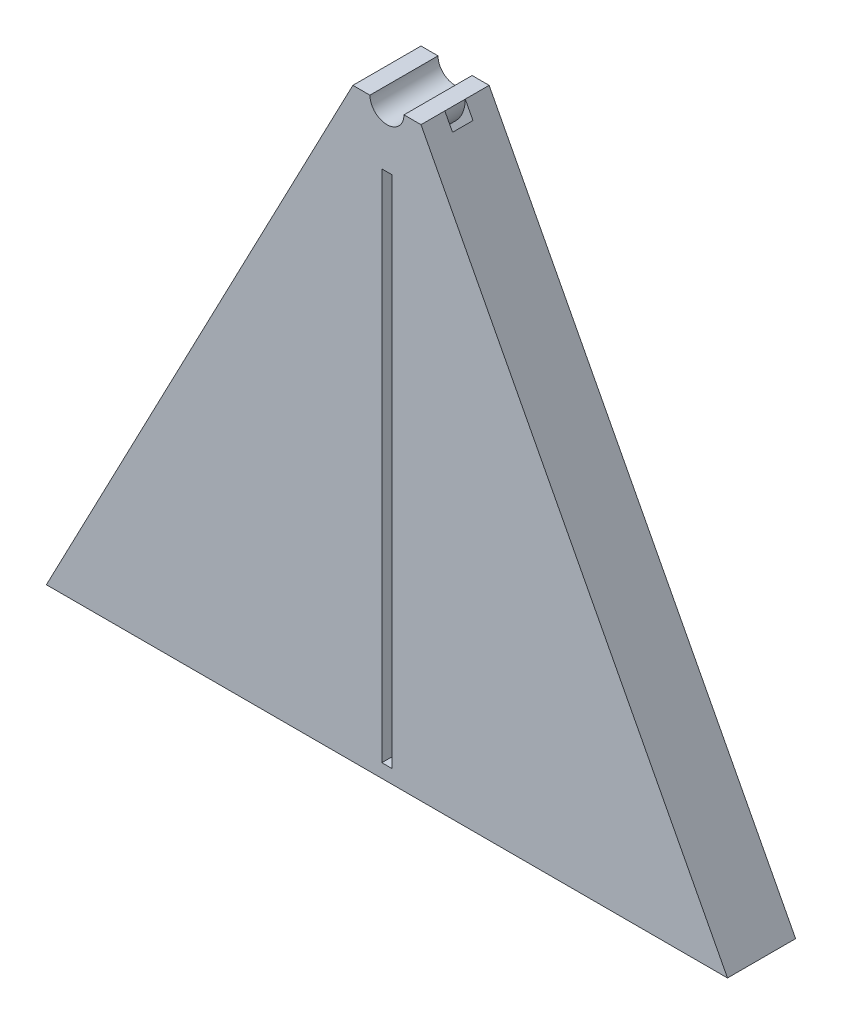
ISO-10303-21;
HEADER;
FILE_DESCRIPTION(('STEP AP214'),'2;1');
FILE_NAME('part.step','',(''),(''),'','','');
FILE_SCHEMA(('AUTOMOTIVE_DESIGN { 1 0 10303 214 1 1 1 1 }'));
ENDSEC;
DATA;
#1=APPLICATION_CONTEXT('core data for automotive mechanical design processes');
#2=APPLICATION_PROTOCOL_DEFINITION('international standard','automotive_design',2000,#1);
#3=PRODUCT_CONTEXT('',#1,'mechanical');
#4=PRODUCT('Part','Part','',(#3));
#5=PRODUCT_RELATED_PRODUCT_CATEGORY('part','',(#4));
#6=PRODUCT_DEFINITION_FORMATION('','',#4);
#7=PRODUCT_DEFINITION_CONTEXT('part definition',#1,'design');
#8=PRODUCT_DEFINITION('design','',#6,#7);
#9=PRODUCT_DEFINITION_SHAPE('','',#8);
#10=(LENGTH_UNIT() NAMED_UNIT(*) SI_UNIT(.MILLI.,.METRE.));
#11=(NAMED_UNIT(*) PLANE_ANGLE_UNIT() SI_UNIT($,.RADIAN.));
#12=(NAMED_UNIT(*) SI_UNIT($,.STERADIAN.) SOLID_ANGLE_UNIT());
#13=UNCERTAINTY_MEASURE_WITH_UNIT(LENGTH_MEASURE(1.E-05),#10,'distance_accuracy_value','');
#14=(GEOMETRIC_REPRESENTATION_CONTEXT(3) GLOBAL_UNCERTAINTY_ASSIGNED_CONTEXT((#13)) GLOBAL_UNIT_ASSIGNED_CONTEXT((#10,
#11,#12)) REPRESENTATION_CONTEXT('',''));
#15=CARTESIAN_POINT('',(0.,0.,0.));
#16=DIRECTION('',(0.,0.,1.));
#17=DIRECTION('',(1.,0.,0.));
#18=AXIS2_PLACEMENT_3D('',#15,#16,#17);
#19=CARTESIAN_POINT('',(0.,0.,3.5));
#20=DIRECTION('',(0.,0.,1.));
#21=DIRECTION('',(1.,0.,0.));
#22=AXIS2_PLACEMENT_3D('',#19,#20,#21);
#23=CYLINDRICAL_SURFACE('',#22,6.5);
#24=CARTESIAN_POINT('',(0.,0.,6.5));
#25=DIRECTION('',(0.,0.,1.));
#26=DIRECTION('',(1.,0.,0.));
#27=AXIS2_PLACEMENT_3D('',#24,#25,#26);
#28=CIRCLE('',#27,6.5);
#29=CARTESIAN_POINT('',(-6.13045913441684,-2.16043301244106,6.5));
#30=VERTEX_POINT('',#29);
#31=CARTESIAN_POINT('',(6.13045913441684,-2.16043301244105,6.5));
#32=VERTEX_POINT('',#31);
#33=EDGE_CURVE('E196',#30,#32,#28,.T.);
#34=ORIENTED_EDGE('',*,*,#33,.T.);
#35=DIRECTION('',(0.,0.,1.));
#36=VECTOR('',#35,1.);
#37=CARTESIAN_POINT('',(6.13045913441684,-2.16043301244105,3.5));
#38=LINE('',#37,#36);
#39=CARTESIAN_POINT('',(6.13045913441684,-2.16043301244106,3.5));
#40=VERTEX_POINT('',#39);
#41=EDGE_CURVE('E211',#40,#32,#38,.T.);
#42=ORIENTED_EDGE('',*,*,#41,.F.);
#43=CARTESIAN_POINT('',(0.,0.,3.5));
#44=DIRECTION('',(0.,0.,1.));
#45=DIRECTION('',(1.,0.,0.));
#46=AXIS2_PLACEMENT_3D('',#43,#44,#45);
#47=CIRCLE('',#46,6.5);
#48=CARTESIAN_POINT('',(-6.13045913441684,-2.16043301244106,3.5));
#49=VERTEX_POINT('',#48);
#50=EDGE_CURVE('E207',#49,#40,#47,.T.);
#51=ORIENTED_EDGE('',*,*,#50,.F.);
#52=DIRECTION('',(0.,0.,1.));
#53=VECTOR('',#52,1.);
#54=CARTESIAN_POINT('',(-6.13045913441684,-2.16043301244106,3.5));
#55=LINE('',#54,#53);
#56=EDGE_CURVE('E215',#30,#49,#55,.F.);
#57=ORIENTED_EDGE('',*,*,#56,.F.);
#58=EDGE_LOOP('',(#34,#42,#51,#57));
#59=FACE_BOUND('',#58,.T.);
#60=ADVANCED_FACE('F38',(#59),#23,.F.);
#61=CARTESIAN_POINT('',(0.,0.,3.5));
#62=DIRECTION('',(0.,0.,1.));
#63=DIRECTION('',(1.,0.,0.));
#64=AXIS2_PLACEMENT_3D('',#61,#62,#63);
#65=CYLINDRICAL_SURFACE('',#64,5.);
#66=DIRECTION('',(0.,0.,-1.));
#67=VECTOR('',#66,1.);
#68=CARTESIAN_POINT('',(5.,0.,10.));
#69=LINE('',#68,#67);
#70=CARTESIAN_POINT('',(5.,0.,6.5));
#71=VERTEX_POINT('',#70);
#72=CARTESIAN_POINT('',(5.,0.,3.5));
#73=VERTEX_POINT('',#72);
#74=EDGE_CURVE('E283',#71,#73,#69,.T.);
#75=ORIENTED_EDGE('',*,*,#74,.F.);
#76=CARTESIAN_POINT('',(0.,0.,6.5));
#77=DIRECTION('',(0.,0.,-1.));
#78=DIRECTION('',(1.,0.,0.));
#79=AXIS2_PLACEMENT_3D('',#76,#77,#78);
#80=CIRCLE('',#79,5.);
#81=CARTESIAN_POINT('',(-5.,0.,6.5));
#82=VERTEX_POINT('',#81);
#83=EDGE_CURVE('E183',#71,#82,#80,.T.);
#84=ORIENTED_EDGE('',*,*,#83,.T.);
#85=DIRECTION('',(0.,0.,-1.));
#86=VECTOR('',#85,1.);
#87=CARTESIAN_POINT('',(-5.,0.,10.));
#88=LINE('',#87,#86);
#89=CARTESIAN_POINT('',(-5.,0.,3.5));
#90=VERTEX_POINT('',#89);
#91=EDGE_CURVE('E271',#82,#90,#88,.T.);
#92=ORIENTED_EDGE('',*,*,#91,.T.);
#93=CARTESIAN_POINT('',(0.,0.,3.5));
#94=DIRECTION('',(0.,0.,1.));
#95=DIRECTION('',(1.,0.,0.));
#96=AXIS2_PLACEMENT_3D('',#93,#94,#95);
#97=CIRCLE('',#96,5.);
#98=EDGE_CURVE('E203',#90,#73,#97,.T.);
#99=ORIENTED_EDGE('',*,*,#98,.T.);
#100=EDGE_LOOP('',(#75,#84,#92,#99));
#101=FACE_BOUND('',#100,.T.);
#102=ADVANCED_FACE('F317',(#101),#65,.T.);
#103=CARTESIAN_POINT('',(-5.,0.,10.));
#104=DIRECTION('',(0.886033106102623,-0.463621974123465,0.));
#105=DIRECTION('',(0.463621974123465,0.886033106102623,0.));
#106=AXIS2_PLACEMENT_3D('',#103,#104,#105);
#107=PLANE('',#106);
#108=DIRECTION('',(-0.463621974123465,-0.886033106102622,0.));
#109=VECTOR('',#108,1.);
#110=CARTESIAN_POINT('',(-5.,0.,10.));
#111=LINE('',#110,#109);
#112=CARTESIAN_POINT('',(-5.,0.,10.));
#113=VERTEX_POINT('',#112);
#114=CARTESIAN_POINT('',(-50.,-86.,10.));
#115=VERTEX_POINT('',#114);
#116=EDGE_CURVE('E227',#113,#115,#111,.T.);
#117=ORIENTED_EDGE('',*,*,#116,.F.);
#118=EDGE_CURVE('E267',#113,#82,#88,.T.);
#119=ORIENTED_EDGE('',*,*,#118,.T.);
#120=DIRECTION('',(-0.463621974123465,-0.886033106102622,0.));
#121=VECTOR('',#120,1.);
#122=CARTESIAN_POINT('',(-5.,0.,6.5));
#123=LINE('',#122,#121);
#124=EDGE_CURVE('E192',#82,#30,#123,.T.);
#125=ORIENTED_EDGE('',*,*,#124,.T.);
#126=ORIENTED_EDGE('',*,*,#56,.T.);
#127=DIRECTION('',(-0.463621974123465,-0.886033106102623,0.));
#128=VECTOR('',#127,1.);
#129=CARTESIAN_POINT('',(-5.,0.,3.5));
#130=LINE('',#129,#128);
#131=EDGE_CURVE('E222',#90,#49,#130,.T.);
#132=ORIENTED_EDGE('',*,*,#131,.F.);
#133=CARTESIAN_POINT('',(-5.,0.,0.));
#134=VERTEX_POINT('',#133);
#135=EDGE_CURVE('E247',#90,#134,#88,.T.);
#136=ORIENTED_EDGE('',*,*,#135,.T.);
#137=DIRECTION('',(-0.463621974123465,-0.886033106102622,0.));
#138=VECTOR('',#137,1.);
#139=CARTESIAN_POINT('',(-5.,0.,0.));
#140=LINE('',#139,#138);
#141=CARTESIAN_POINT('',(-50.,-86.,0.));
#142=VERTEX_POINT('',#141);
#143=EDGE_CURVE('E226',#134,#142,#140,.T.);
#144=ORIENTED_EDGE('',*,*,#143,.T.);
#145=DIRECTION('',(0.,0.,-1.));
#146=VECTOR('',#145,1.);
#147=CARTESIAN_POINT('',(-50.,-86.,10.));
#148=LINE('',#147,#146);
#149=EDGE_CURVE('E11',#115,#142,#148,.T.);
#150=ORIENTED_EDGE('',*,*,#149,.F.);
#151=EDGE_LOOP('',(#117,#119,#125,#126,#132,#136,#144,#150));
#152=FACE_BOUND('',#151,.T.);
#153=ADVANCED_FACE('F40',(#152),#107,.F.);
#154=CARTESIAN_POINT('',(-50.,-86.,10.));
#155=DIRECTION('',(0.,1.,0.));
#156=DIRECTION('',(0.,0.,1.));
#157=AXIS2_PLACEMENT_3D('',#154,#155,#156);
#158=PLANE('',#157);
#159=DIRECTION('',(1.,0.,0.));
#160=VECTOR('',#159,1.);
#161=CARTESIAN_POINT('',(-50.,-86.,0.));
#162=LINE('',#161,#160);
#163=CARTESIAN_POINT('',(50.,-86.,0.));
#164=VERTEX_POINT('',#163);
#165=EDGE_CURVE('E251',#142,#164,#162,.T.);
#166=ORIENTED_EDGE('',*,*,#165,.T.);
#167=DIRECTION('',(0.,0.,-1.));
#168=VECTOR('',#167,1.);
#169=CARTESIAN_POINT('',(50.,-86.,10.));
#170=LINE('',#169,#168);
#171=CARTESIAN_POINT('',(50.,-86.,10.));
#172=VERTEX_POINT('',#171);
#173=EDGE_CURVE('E47',#172,#164,#170,.T.);
#174=ORIENTED_EDGE('',*,*,#173,.F.);
#175=DIRECTION('',(1.,0.,0.));
#176=VECTOR('',#175,1.);
#177=CARTESIAN_POINT('',(-50.,-86.,10.));
#178=LINE('',#177,#176);
#179=EDGE_CURVE('E230',#115,#172,#178,.T.);
#180=ORIENTED_EDGE('',*,*,#179,.F.);
#181=ORIENTED_EDGE('',*,*,#149,.T.);
#182=EDGE_LOOP('',(#166,#174,#180,#181));
#183=FACE_BOUND('',#182,.T.);
#184=ADVANCED_FACE('F362',(#183),#158,.F.);
#185=CARTESIAN_POINT('',(50.,-86.,10.));
#186=DIRECTION('',(-0.886033106102623,-0.463621974123465,0.));
#187=DIRECTION('',(0.463621974123465,-0.886033106102623,0.));
#188=AXIS2_PLACEMENT_3D('',#185,#186,#187);
#189=PLANE('',#188);
#190=DIRECTION('',(-0.463621974123465,0.886033106102623,0.));
#191=VECTOR('',#190,1.);
#192=CARTESIAN_POINT('',(50.,-86.,3.5));
#193=LINE('',#192,#191);
#194=EDGE_CURVE('E218',#40,#73,#193,.T.);
#195=ORIENTED_EDGE('',*,*,#194,.F.);
#196=ORIENTED_EDGE('',*,*,#41,.T.);
#197=DIRECTION('',(-0.463621974123465,0.886033106102622,0.));
#198=VECTOR('',#197,1.);
#199=CARTESIAN_POINT('',(5.,0.,6.5));
#200=LINE('',#199,#198);
#201=EDGE_CURVE('E199',#32,#71,#200,.T.);
#202=ORIENTED_EDGE('',*,*,#201,.T.);
#203=CARTESIAN_POINT('',(5.,0.,10.));
#204=VERTEX_POINT('',#203);
#205=EDGE_CURVE('E280',#204,#71,#69,.T.);
#206=ORIENTED_EDGE('',*,*,#205,.F.);
#207=DIRECTION('',(-0.463621974123465,0.886033106102622,0.));
#208=VECTOR('',#207,1.);
#209=CARTESIAN_POINT('',(50.,-86.,10.));
#210=LINE('',#209,#208);
#211=EDGE_CURVE('E234',#172,#204,#210,.T.);
#212=ORIENTED_EDGE('',*,*,#211,.F.);
#213=ORIENTED_EDGE('',*,*,#173,.T.);
#214=DIRECTION('',(-0.463621974123465,0.886033106102622,0.));
#215=VECTOR('',#214,1.);
#216=CARTESIAN_POINT('',(50.,-86.,0.));
#217=LINE('',#216,#215);
#218=CARTESIAN_POINT('',(5.,0.,0.));
#219=VERTEX_POINT('',#218);
#220=EDGE_CURVE('E254',#164,#219,#217,.T.);
#221=ORIENTED_EDGE('',*,*,#220,.T.);
#222=EDGE_CURVE('E279',#73,#219,#69,.T.);
#223=ORIENTED_EDGE('',*,*,#222,.F.);
#224=EDGE_LOOP('',(#195,#196,#202,#206,#212,#213,#221,#223));
#225=FACE_BOUND('',#224,.T.);
#226=ADVANCED_FACE('F291',(#225),#189,.F.);
#227=CARTESIAN_POINT('',(5.,0.,10.));
#228=DIRECTION('',(0.,-1.,0.));
#229=DIRECTION('',(1.,0.,0.));
#230=AXIS2_PLACEMENT_3D('',#227,#228,#229);
#231=PLANE('',#230);
#232=DIRECTION('',(-1.,0.,0.));
#233=VECTOR('',#232,1.);
#234=CARTESIAN_POINT('',(5.,0.,0.));
#235=LINE('',#234,#233);
#236=CARTESIAN_POINT('',(2.5,0.,0.));
#237=VERTEX_POINT('',#236);
#238=EDGE_CURVE('E258',#219,#237,#235,.T.);
#239=ORIENTED_EDGE('',*,*,#238,.T.);
#240=DIRECTION('',(0.,0.,-1.));
#241=VECTOR('',#240,1.);
#242=CARTESIAN_POINT('',(2.5,0.,10.));
#243=LINE('',#242,#241);
#244=CARTESIAN_POINT('',(2.5,0.,10.));
#245=VERTEX_POINT('',#244);
#246=EDGE_CURVE('E275',#245,#237,#243,.T.);
#247=ORIENTED_EDGE('',*,*,#246,.F.);
#248=DIRECTION('',(-1.,0.,0.));
#249=VECTOR('',#248,1.);
#250=CARTESIAN_POINT('',(5.,0.,10.));
#251=LINE('',#250,#249);
#252=EDGE_CURVE('E237',#204,#245,#251,.T.);
#253=ORIENTED_EDGE('',*,*,#252,.F.);
#254=ORIENTED_EDGE('',*,*,#205,.T.);
#255=ORIENTED_EDGE('',*,*,#74,.T.);
#256=ORIENTED_EDGE('',*,*,#222,.T.);
#257=EDGE_LOOP('',(#239,#247,#253,#254,#255,#256));
#258=FACE_BOUND('',#257,.T.);
#259=ADVANCED_FACE('F302',(#258),#231,.F.);
#260=CARTESIAN_POINT('',(0.,0.,10.));
#261=DIRECTION('',(0.,0.,-1.));
#262=DIRECTION('',(-1.,0.,0.));
#263=AXIS2_PLACEMENT_3D('',#260,#261,#262);
#264=CYLINDRICAL_SURFACE('',#263,2.5);
#265=CARTESIAN_POINT('',(0.,0.,0.));
#266=DIRECTION('',(0.,0.,-1.));
#267=DIRECTION('',(1.,0.,0.));
#268=AXIS2_PLACEMENT_3D('',#265,#266,#267);
#269=CIRCLE('',#268,2.5);
#270=CARTESIAN_POINT('',(-2.5,0.,0.));
#271=VERTEX_POINT('',#270);
#272=EDGE_CURVE('E261',#237,#271,#269,.T.);
#273=ORIENTED_EDGE('',*,*,#272,.T.);
#274=DIRECTION('',(0.,0.,-1.));
#275=VECTOR('',#274,1.);
#276=CARTESIAN_POINT('',(-2.5,0.,10.));
#277=LINE('',#276,#275);
#278=CARTESIAN_POINT('',(-2.5,0.,10.));
#279=VERTEX_POINT('',#278);
#280=EDGE_CURVE('E270',#279,#271,#277,.T.);
#281=ORIENTED_EDGE('',*,*,#280,.F.);
#282=CARTESIAN_POINT('',(0.,0.,10.));
#283=DIRECTION('',(0.,0.,-1.));
#284=DIRECTION('',(1.,0.,0.));
#285=AXIS2_PLACEMENT_3D('',#282,#283,#284);
#286=CIRCLE('',#285,2.5);
#287=EDGE_CURVE('E240',#245,#279,#286,.T.);
#288=ORIENTED_EDGE('',*,*,#287,.F.);
#289=ORIENTED_EDGE('',*,*,#246,.T.);
#290=EDGE_LOOP('',(#273,#281,#288,#289));
#291=FACE_BOUND('',#290,.T.);
#292=ADVANCED_FACE('F306',(#291),#264,.F.);
#293=CARTESIAN_POINT('',(-2.5,0.,10.));
#294=DIRECTION('',(0.,-1.,0.));
#295=DIRECTION('',(1.,0.,0.));
#296=AXIS2_PLACEMENT_3D('',#293,#294,#295);
#297=PLANE('',#296);
#298=DIRECTION('',(-1.,0.,0.));
#299=VECTOR('',#298,1.);
#300=CARTESIAN_POINT('',(-2.5,0.,0.));
#301=LINE('',#300,#299);
#302=EDGE_CURVE('E231',#271,#134,#301,.T.);
#303=ORIENTED_EDGE('',*,*,#302,.T.);
#304=ORIENTED_EDGE('',*,*,#135,.F.);
#305=ORIENTED_EDGE('',*,*,#91,.F.);
#306=ORIENTED_EDGE('',*,*,#118,.F.);
#307=DIRECTION('',(-1.,0.,0.));
#308=VECTOR('',#307,1.);
#309=CARTESIAN_POINT('',(-2.5,0.,10.));
#310=LINE('',#309,#308);
#311=EDGE_CURVE('E243',#279,#113,#310,.T.);
#312=ORIENTED_EDGE('',*,*,#311,.F.);
#313=ORIENTED_EDGE('',*,*,#280,.T.);
#314=EDGE_LOOP('',(#303,#304,#305,#306,#312,#313));
#315=FACE_BOUND('',#314,.T.);
#316=ADVANCED_FACE('F329',(#315),#297,.F.);
#317=CARTESIAN_POINT('',(0.,0.,10.));
#318=DIRECTION('',(0.,0.,1.));
#319=DIRECTION('',(1.,0.,0.));
#320=AXIS2_PLACEMENT_3D('',#317,#318,#319);
#321=PLANE('',#320);
#322=DIRECTION('',(0.,-1.,0.));
#323=VECTOR('',#322,1.);
#324=CARTESIAN_POINT('',(-0.750000000000009,-8.5,10.));
#325=LINE('',#324,#323);
#326=CARTESIAN_POINT('',(-0.750000000000009,-8.5,10.));
#327=VERTEX_POINT('',#326);
#328=CARTESIAN_POINT('',(-0.75,-84.,10.));
#329=VERTEX_POINT('',#328);
#330=EDGE_CURVE('E54',#327,#329,#325,.T.);
#331=ORIENTED_EDGE('',*,*,#330,.F.);
#332=DIRECTION('',(-1.,0.,0.));
#333=VECTOR('',#332,1.);
#334=CARTESIAN_POINT('',(-0.750000000000009,-8.5,10.));
#335=LINE('',#334,#333);
#336=CARTESIAN_POINT('',(0.750000000000009,-8.5,10.));
#337=VERTEX_POINT('',#336);
#338=EDGE_CURVE('E161',#337,#327,#335,.T.);
#339=ORIENTED_EDGE('',*,*,#338,.F.);
#340=DIRECTION('',(0.,1.,0.));
#341=VECTOR('',#340,1.);
#342=CARTESIAN_POINT('',(0.750000000000009,-8.5,10.));
#343=LINE('',#342,#341);
#344=CARTESIAN_POINT('',(0.75,-84.,10.));
#345=VERTEX_POINT('',#344);
#346=EDGE_CURVE('E165',#345,#337,#343,.T.);
#347=ORIENTED_EDGE('',*,*,#346,.F.);
#348=DIRECTION('',(1.,0.,0.));
#349=VECTOR('',#348,1.);
#350=CARTESIAN_POINT('',(-0.75,-84.,10.));
#351=LINE('',#350,#349);
#352=EDGE_CURVE('E174',#329,#345,#351,.T.);
#353=ORIENTED_EDGE('',*,*,#352,.F.);
#354=EDGE_LOOP('',(#331,#339,#347,#353));
#355=FACE_BOUND('',#354,.T.);
#356=ORIENTED_EDGE('',*,*,#211,.T.);
#357=ORIENTED_EDGE('',*,*,#252,.T.);
#358=ORIENTED_EDGE('',*,*,#287,.T.);
#359=ORIENTED_EDGE('',*,*,#311,.T.);
#360=ORIENTED_EDGE('',*,*,#116,.T.);
#361=ORIENTED_EDGE('',*,*,#179,.T.);
#362=EDGE_LOOP('',(#356,#357,#358,#359,#360,#361));
#363=FACE_BOUND('',#362,.T.);
#364=ADVANCED_FACE('F310',(#355,#363),#321,.T.);
#365=CARTESIAN_POINT('',(0.,0.,0.));
#366=DIRECTION('',(0.,0.,1.));
#367=DIRECTION('',(1.,0.,0.));
#368=AXIS2_PLACEMENT_3D('',#365,#366,#367);
#369=PLANE('',#368);
#370=DIRECTION('',(-1.,0.,0.));
#371=VECTOR('',#370,1.);
#372=CARTESIAN_POINT('',(-0.750000000000009,-8.5,0.));
#373=LINE('',#372,#371);
#374=CARTESIAN_POINT('',(0.750000000000009,-8.5,0.));
#375=VERTEX_POINT('',#374);
#376=CARTESIAN_POINT('',(-0.750000000000009,-8.5,0.));
#377=VERTEX_POINT('',#376);
#378=EDGE_CURVE('E149',#375,#377,#373,.T.);
#379=ORIENTED_EDGE('',*,*,#378,.T.);
#380=DIRECTION('',(0.,-1.,0.));
#381=VECTOR('',#380,1.);
#382=CARTESIAN_POINT('',(-0.750000000000009,-8.5,0.));
#383=LINE('',#382,#381);
#384=CARTESIAN_POINT('',(-0.75,-84.,0.));
#385=VERTEX_POINT('',#384);
#386=EDGE_CURVE('E142',#377,#385,#383,.T.);
#387=ORIENTED_EDGE('',*,*,#386,.T.);
#388=DIRECTION('',(1.,0.,0.));
#389=VECTOR('',#388,1.);
#390=CARTESIAN_POINT('',(-0.75,-84.,0.));
#391=LINE('',#390,#389);
#392=CARTESIAN_POINT('',(0.75,-84.,0.));
#393=VERTEX_POINT('',#392);
#394=EDGE_CURVE('E152',#385,#393,#391,.T.);
#395=ORIENTED_EDGE('',*,*,#394,.T.);
#396=DIRECTION('',(0.,1.,0.));
#397=VECTOR('',#396,1.);
#398=CARTESIAN_POINT('',(0.750000000000009,-8.5,0.));
#399=LINE('',#398,#397);
#400=EDGE_CURVE('E62',#393,#375,#399,.T.);
#401=ORIENTED_EDGE('',*,*,#400,.T.);
#402=EDGE_LOOP('',(#379,#387,#395,#401));
#403=FACE_BOUND('',#402,.T.);
#404=ORIENTED_EDGE('',*,*,#143,.F.);
#405=ORIENTED_EDGE('',*,*,#302,.F.);
#406=ORIENTED_EDGE('',*,*,#272,.F.);
#407=ORIENTED_EDGE('',*,*,#238,.F.);
#408=ORIENTED_EDGE('',*,*,#220,.F.);
#409=ORIENTED_EDGE('',*,*,#165,.F.);
#410=EDGE_LOOP('',(#404,#405,#406,#407,#408,#409));
#411=FACE_BOUND('',#410,.T.);
#412=ADVANCED_FACE('F157',(#403,#411),#369,.F.);
#413=CARTESIAN_POINT('',(0.,0.,3.5));
#414=DIRECTION('',(0.,0.,1.));
#415=DIRECTION('',(1.,0.,0.));
#416=AXIS2_PLACEMENT_3D('',#413,#414,#415);
#417=PLANE('',#416);
#418=ORIENTED_EDGE('',*,*,#131,.T.);
#419=ORIENTED_EDGE('',*,*,#50,.T.);
#420=ORIENTED_EDGE('',*,*,#194,.T.);
#421=ORIENTED_EDGE('',*,*,#98,.F.);
#422=EDGE_LOOP('',(#418,#419,#420,#421));
#423=FACE_BOUND('',#422,.T.);
#424=ADVANCED_FACE('F335',(#423),#417,.T.);
#425=CARTESIAN_POINT('',(0.,0.,6.5));
#426=DIRECTION('',(0.,0.,1.));
#427=DIRECTION('',(1.,0.,0.));
#428=AXIS2_PLACEMENT_3D('',#425,#426,#427);
#429=PLANE('',#428);
#430=ORIENTED_EDGE('',*,*,#83,.F.);
#431=ORIENTED_EDGE('',*,*,#201,.F.);
#432=ORIENTED_EDGE('',*,*,#33,.F.);
#433=ORIENTED_EDGE('',*,*,#124,.F.);
#434=EDGE_LOOP('',(#430,#431,#432,#433));
#435=FACE_BOUND('',#434,.T.);
#436=ADVANCED_FACE('F331',(#435),#429,.F.);
#437=CARTESIAN_POINT('',(-0.750000000000009,-8.5,0.));
#438=DIRECTION('',(-1.,0.,0.));
#439=DIRECTION('',(0.,-1.,0.));
#440=AXIS2_PLACEMENT_3D('',#437,#438,#439);
#441=PLANE('',#440);
#442=ORIENTED_EDGE('',*,*,#330,.T.);
#443=DIRECTION('',(0.,0.,1.));
#444=VECTOR('',#443,1.);
#445=CARTESIAN_POINT('',(-0.75,-84.,0.));
#446=LINE('',#445,#444);
#447=EDGE_CURVE('E138',#385,#329,#446,.T.);
#448=ORIENTED_EDGE('',*,*,#447,.F.);
#449=ORIENTED_EDGE('',*,*,#386,.F.);
#450=DIRECTION('',(0.,0.,1.));
#451=VECTOR('',#450,1.);
#452=CARTESIAN_POINT('',(-0.750000000000009,-8.5,0.));
#453=LINE('',#452,#451);
#454=EDGE_CURVE('E180',#377,#327,#453,.T.);
#455=ORIENTED_EDGE('',*,*,#454,.T.);
#456=EDGE_LOOP('',(#442,#448,#449,#455));
#457=FACE_BOUND('',#456,.T.);
#458=ADVANCED_FACE('F140',(#457),#441,.F.);
#459=CARTESIAN_POINT('',(-0.750000000000009,-8.5,0.));
#460=DIRECTION('',(0.,1.,0.));
#461=DIRECTION('',(0.,0.,1.));
#462=AXIS2_PLACEMENT_3D('',#459,#460,#461);
#463=PLANE('',#462);
#464=ORIENTED_EDGE('',*,*,#338,.T.);
#465=ORIENTED_EDGE('',*,*,#454,.F.);
#466=ORIENTED_EDGE('',*,*,#378,.F.);
#467=DIRECTION('',(0.,0.,1.));
#468=VECTOR('',#467,1.);
#469=CARTESIAN_POINT('',(0.750000000000009,-8.5,0.));
#470=LINE('',#469,#468);
#471=EDGE_CURVE('E184',#375,#337,#470,.T.);
#472=ORIENTED_EDGE('',*,*,#471,.T.);
#473=EDGE_LOOP('',(#464,#465,#466,#472));
#474=FACE_BOUND('',#473,.T.);
#475=ADVANCED_FACE('F437',(#474),#463,.F.);
#476=CARTESIAN_POINT('',(0.750000000000009,-8.5,0.));
#477=DIRECTION('',(1.,0.,0.));
#478=DIRECTION('',(0.,1.,0.));
#479=AXIS2_PLACEMENT_3D('',#476,#477,#478);
#480=PLANE('',#479);
#481=ORIENTED_EDGE('',*,*,#346,.T.);
#482=ORIENTED_EDGE('',*,*,#471,.F.);
#483=ORIENTED_EDGE('',*,*,#400,.F.);
#484=DIRECTION('',(0.,0.,1.));
#485=VECTOR('',#484,1.);
#486=CARTESIAN_POINT('',(0.75,-84.,0.));
#487=LINE('',#486,#485);
#488=EDGE_CURVE('E148',#393,#345,#487,.T.);
#489=ORIENTED_EDGE('',*,*,#488,.T.);
#490=EDGE_LOOP('',(#481,#482,#483,#489));
#491=FACE_BOUND('',#490,.T.);
#492=ADVANCED_FACE('F446',(#491),#480,.F.);
#493=CARTESIAN_POINT('',(-0.75,-84.,0.));
#494=DIRECTION('',(0.,-1.,0.));
#495=DIRECTION('',(0.,0.,-1.));
#496=AXIS2_PLACEMENT_3D('',#493,#494,#495);
#497=PLANE('',#496);
#498=ORIENTED_EDGE('',*,*,#352,.T.);
#499=ORIENTED_EDGE('',*,*,#488,.F.);
#500=ORIENTED_EDGE('',*,*,#394,.F.);
#501=ORIENTED_EDGE('',*,*,#447,.T.);
#502=EDGE_LOOP('',(#498,#499,#500,#501));
#503=FACE_BOUND('',#502,.T.);
#504=ADVANCED_FACE('F153',(#503),#497,.F.);
#505=CLOSED_SHELL('',(#60,#102,#153,#184,#226,#259,#292,#316,#364,#412,#424,#436,#458,#475,#492,#504));
#506=MANIFOLD_SOLID_BREP('B2',#505);
#507=ADVANCED_BREP_SHAPE_REPRESENTATION('',(#18,#506),#14);
#508=SHAPE_DEFINITION_REPRESENTATION(#9,#507);
ENDSEC;
END-ISO-10303-21;
